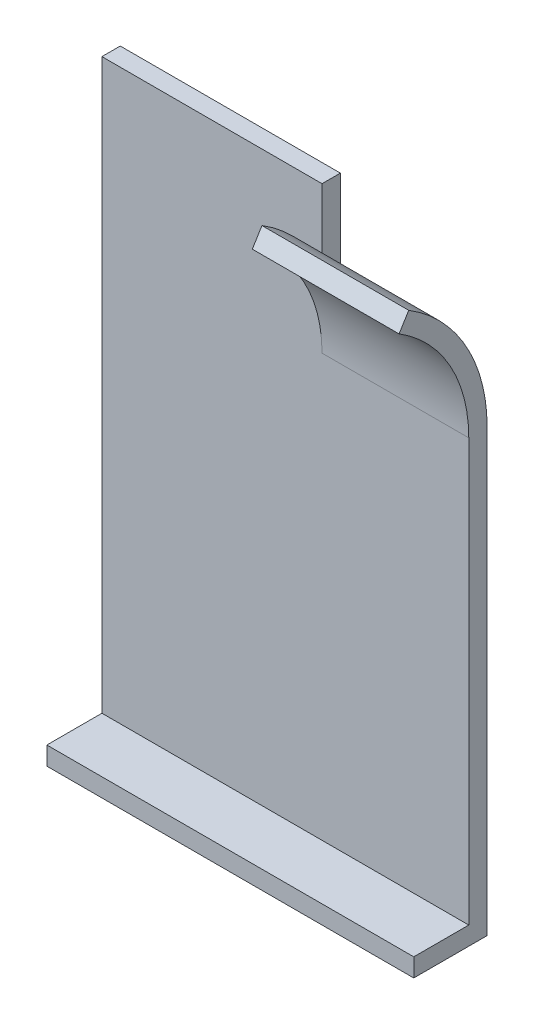
ISO-10303-21;
HEADER;
FILE_DESCRIPTION(('STEP AP214'),'2;1');
FILE_NAME('part.step','',(''),(''),'','','');
FILE_SCHEMA(('AUTOMOTIVE_DESIGN { 1 0 10303 214 1 1 1 1 }'));
ENDSEC;
DATA;
#1=APPLICATION_CONTEXT('core data for automotive mechanical design processes');
#2=APPLICATION_PROTOCOL_DEFINITION('international standard','automotive_design',2000,#1);
#3=PRODUCT_CONTEXT('',#1,'mechanical');
#4=PRODUCT('Part','Part','',(#3));
#5=PRODUCT_RELATED_PRODUCT_CATEGORY('part','',(#4));
#6=PRODUCT_DEFINITION_FORMATION('','',#4);
#7=PRODUCT_DEFINITION_CONTEXT('part definition',#1,'design');
#8=PRODUCT_DEFINITION('design','',#6,#7);
#9=PRODUCT_DEFINITION_SHAPE('','',#8);
#10=(LENGTH_UNIT() NAMED_UNIT(*) SI_UNIT(.MILLI.,.METRE.));
#11=(NAMED_UNIT(*) PLANE_ANGLE_UNIT() SI_UNIT($,.RADIAN.));
#12=(NAMED_UNIT(*) SI_UNIT($,.STERADIAN.) SOLID_ANGLE_UNIT());
#13=UNCERTAINTY_MEASURE_WITH_UNIT(LENGTH_MEASURE(1.E-05),#10,'distance_accuracy_value','');
#14=(GEOMETRIC_REPRESENTATION_CONTEXT(3) GLOBAL_UNCERTAINTY_ASSIGNED_CONTEXT((#13)) GLOBAL_UNIT_ASSIGNED_CONTEXT((#10,
#11,#12)) REPRESENTATION_CONTEXT('',''));
#15=CARTESIAN_POINT('',(0.,0.,0.));
#16=DIRECTION('',(0.,0.,1.));
#17=DIRECTION('',(1.,0.,0.));
#18=AXIS2_PLACEMENT_3D('',#15,#16,#17);
#19=CARTESIAN_POINT('',(38.1,101.6,3.175));
#20=DIRECTION('',(-1.,0.,0.));
#21=DIRECTION('',(0.,0.,1.));
#22=AXIS2_PLACEMENT_3D('',#19,#20,#21);
#23=PLANE('',#22);
#24=DIRECTION('',(0.,1.,0.));
#25=VECTOR('',#24,1.);
#26=CARTESIAN_POINT('',(38.1,101.6,3.175));
#27=LINE('',#26,#25);
#28=CARTESIAN_POINT('',(38.1,89.2908603613361,3.175));
#29=VERTEX_POINT('',#28);
#30=CARTESIAN_POINT('',(38.1,101.6,3.175));
#31=VERTEX_POINT('',#30);
#32=EDGE_CURVE('E166',#29,#31,#27,.T.);
#33=ORIENTED_EDGE('',*,*,#32,.F.);
#34=CARTESIAN_POINT('',(38.1,76.2,28.575));
#35=DIRECTION('',(-1.,0.,0.));
#36=DIRECTION('',(0.,0.,1.));
#37=AXIS2_PLACEMENT_3D('',#34,#35,#36);
#38=CIRCLE('',#37,28.575);
#39=CARTESIAN_POINT('',(38.1,76.2,0.));
#40=VERTEX_POINT('',#39);
#41=EDGE_CURVE('E157',#40,#29,#38,.F.);
#42=ORIENTED_EDGE('',*,*,#41,.F.);
#43=DIRECTION('',(0.,1.,0.));
#44=VECTOR('',#43,1.);
#45=CARTESIAN_POINT('',(38.1,101.6,0.));
#46=LINE('',#45,#44);
#47=CARTESIAN_POINT('',(38.1,101.6,0.));
#48=VERTEX_POINT('',#47);
#49=EDGE_CURVE('E181',#40,#48,#46,.T.);
#50=ORIENTED_EDGE('',*,*,#49,.T.);
#51=DIRECTION('',(0.,0.,-1.));
#52=VECTOR('',#51,1.);
#53=CARTESIAN_POINT('',(38.1,101.6,3.175));
#54=LINE('',#53,#52);
#55=EDGE_CURVE('E40',#31,#48,#54,.T.);
#56=ORIENTED_EDGE('',*,*,#55,.F.);
#57=EDGE_LOOP('',(#33,#42,#50,#56));
#58=FACE_BOUND('',#57,.T.);
#59=ADVANCED_FACE('F32',(#58),#23,.F.);
#60=CARTESIAN_POINT('',(63.5,0.,3.175));
#61=DIRECTION('',(0.,1.,0.));
#62=DIRECTION('',(0.,0.,1.));
#63=AXIS2_PLACEMENT_3D('',#60,#61,#62);
#64=PLANE('',#63);
#65=DIRECTION('',(1.,0.,0.));
#66=VECTOR('',#65,1.);
#67=CARTESIAN_POINT('',(63.5,0.,0.));
#68=LINE('',#67,#66);
#69=CARTESIAN_POINT('',(0.,0.,0.));
#70=VERTEX_POINT('',#69);
#71=CARTESIAN_POINT('',(63.5,0.,0.));
#72=VERTEX_POINT('',#71);
#73=EDGE_CURVE('E151',#70,#72,#68,.T.);
#74=ORIENTED_EDGE('',*,*,#73,.T.);
#75=DIRECTION('',(0.,0.,-1.));
#76=VECTOR('',#75,1.);
#77=CARTESIAN_POINT('',(63.5,0.,3.175));
#78=LINE('',#77,#76);
#79=CARTESIAN_POINT('',(63.5,0.,12.7));
#80=VERTEX_POINT('',#79);
#81=EDGE_CURVE('E11',#80,#72,#78,.T.);
#82=ORIENTED_EDGE('',*,*,#81,.F.);
#83=DIRECTION('',(1.,0.,0.));
#84=VECTOR('',#83,1.);
#85=CARTESIAN_POINT('',(-13.0908603613361,0.,12.7));
#86=LINE('',#85,#84);
#87=CARTESIAN_POINT('',(0.,0.,12.7));
#88=VERTEX_POINT('',#87);
#89=EDGE_CURVE('E127',#88,#80,#86,.T.);
#90=ORIENTED_EDGE('',*,*,#89,.F.);
#91=DIRECTION('',(0.,0.,-1.));
#92=VECTOR('',#91,1.);
#93=CARTESIAN_POINT('',(0.,0.,3.175));
#94=LINE('',#93,#92);
#95=EDGE_CURVE('E173',#88,#70,#94,.T.);
#96=ORIENTED_EDGE('',*,*,#95,.T.);
#97=EDGE_LOOP('',(#74,#82,#90,#96));
#98=FACE_BOUND('',#97,.T.);
#99=ADVANCED_FACE('F34',(#98),#64,.F.);
#100=CARTESIAN_POINT('',(63.5,76.2,3.175));
#101=DIRECTION('',(-1.,0.,0.));
#102=DIRECTION('',(0.,0.,1.));
#103=AXIS2_PLACEMENT_3D('',#100,#101,#102);
#104=PLANE('',#103);
#105=DIRECTION('',(0.,1.,0.));
#106=VECTOR('',#105,1.);
#107=CARTESIAN_POINT('',(63.5,76.2,3.175));
#108=LINE('',#107,#106);
#109=CARTESIAN_POINT('',(63.5,3.175,3.175));
#110=VERTEX_POINT('',#109);
#111=CARTESIAN_POINT('',(63.5,76.2,3.175));
#112=VERTEX_POINT('',#111);
#113=EDGE_CURVE('E116',#110,#112,#108,.T.);
#114=ORIENTED_EDGE('',*,*,#113,.F.);
#115=DIRECTION('',(0.,0.,1.));
#116=VECTOR('',#115,1.);
#117=CARTESIAN_POINT('',(63.5,3.175,12.7));
#118=LINE('',#117,#116);
#119=CARTESIAN_POINT('',(63.5,3.175,12.7));
#120=VERTEX_POINT('',#119);
#121=EDGE_CURVE('E110',#110,#120,#118,.T.);
#122=ORIENTED_EDGE('',*,*,#121,.T.);
#123=DIRECTION('',(0.,-1.,0.));
#124=VECTOR('',#123,1.);
#125=CARTESIAN_POINT('',(63.5,0.,12.7));
#126=LINE('',#125,#124);
#127=EDGE_CURVE('E114',#120,#80,#126,.T.);
#128=ORIENTED_EDGE('',*,*,#127,.T.);
#129=ORIENTED_EDGE('',*,*,#81,.T.);
#130=DIRECTION('',(0.,1.,0.));
#131=VECTOR('',#130,1.);
#132=CARTESIAN_POINT('',(63.5,76.2,0.));
#133=LINE('',#132,#131);
#134=CARTESIAN_POINT('',(63.5,76.2,0.));
#135=VERTEX_POINT('',#134);
#136=EDGE_CURVE('E176',#72,#135,#133,.T.);
#137=ORIENTED_EDGE('',*,*,#136,.T.);
#138=CARTESIAN_POINT('',(63.5,76.2,28.575));
#139=DIRECTION('',(1.,0.,0.));
#140=DIRECTION('',(0.,0.,-1.));
#141=AXIS2_PLACEMENT_3D('',#138,#139,#140);
#142=CIRCLE('',#141,28.575);
#143=CARTESIAN_POINT('',(63.5,100.520246123022,13.573125));
#144=VERTEX_POINT('',#143);
#145=EDGE_CURVE('E144',#135,#144,#142,.T.);
#146=ORIENTED_EDGE('',*,*,#145,.T.);
#147=DIRECTION('',(0.,-0.85110222652746,0.525));
#148=VECTOR('',#147,1.);
#149=CARTESIAN_POINT('',(63.5,97.8179965537975,15.24));
#150=LINE('',#149,#148);
#151=CARTESIAN_POINT('',(63.5,97.8179965537975,15.24));
#152=VERTEX_POINT('',#151);
#153=EDGE_CURVE('E140',#144,#152,#150,.T.);
#154=ORIENTED_EDGE('',*,*,#153,.T.);
#155=CARTESIAN_POINT('',(63.5,76.2,28.575));
#156=DIRECTION('',(-1.,0.,0.));
#157=DIRECTION('',(0.,0.,-1.));
#158=AXIS2_PLACEMENT_3D('',#155,#156,#157);
#159=CIRCLE('',#158,25.4);
#160=EDGE_CURVE('E139',#152,#112,#159,.T.);
#161=ORIENTED_EDGE('',*,*,#160,.T.);
#162=EDGE_LOOP('',(#114,#122,#128,#129,#137,#146,#154,#161));
#163=FACE_BOUND('',#162,.T.);
#164=ADVANCED_FACE('F112',(#163),#104,.F.);
#165=CARTESIAN_POINT('',(0.,101.6,3.175));
#166=DIRECTION('',(0.,-1.,0.));
#167=DIRECTION('',(0.,0.,-1.));
#168=AXIS2_PLACEMENT_3D('',#165,#166,#167);
#169=PLANE('',#168);
#170=DIRECTION('',(-1.,0.,0.));
#171=VECTOR('',#170,1.);
#172=CARTESIAN_POINT('',(0.,101.6,0.));
#173=LINE('',#172,#171);
#174=CARTESIAN_POINT('',(0.,101.6,0.));
#175=VERTEX_POINT('',#174);
#176=EDGE_CURVE('E183',#48,#175,#173,.T.);
#177=ORIENTED_EDGE('',*,*,#176,.T.);
#178=DIRECTION('',(0.,0.,-1.));
#179=VECTOR('',#178,1.);
#180=CARTESIAN_POINT('',(0.,101.6,3.175));
#181=LINE('',#180,#179);
#182=CARTESIAN_POINT('',(0.,101.6,3.175));
#183=VERTEX_POINT('',#182);
#184=EDGE_CURVE('E188',#183,#175,#181,.T.);
#185=ORIENTED_EDGE('',*,*,#184,.F.);
#186=DIRECTION('',(-1.,0.,0.));
#187=VECTOR('',#186,1.);
#188=CARTESIAN_POINT('',(0.,101.6,3.175));
#189=LINE('',#188,#187);
#190=EDGE_CURVE('E170',#31,#183,#189,.T.);
#191=ORIENTED_EDGE('',*,*,#190,.F.);
#192=ORIENTED_EDGE('',*,*,#55,.T.);
#193=EDGE_LOOP('',(#177,#185,#191,#192));
#194=FACE_BOUND('',#193,.T.);
#195=ADVANCED_FACE('F195',(#194),#169,.F.);
#196=CARTESIAN_POINT('',(0.,0.,3.175));
#197=DIRECTION('',(1.,0.,0.));
#198=DIRECTION('',(0.,0.,-1.));
#199=AXIS2_PLACEMENT_3D('',#196,#197,#198);
#200=PLANE('',#199);
#201=DIRECTION('',(0.,-1.,0.));
#202=VECTOR('',#201,1.);
#203=CARTESIAN_POINT('',(0.,0.,0.));
#204=LINE('',#203,#202);
#205=EDGE_CURVE('E164',#175,#70,#204,.T.);
#206=ORIENTED_EDGE('',*,*,#205,.T.);
#207=ORIENTED_EDGE('',*,*,#95,.F.);
#208=DIRECTION('',(0.,1.,0.));
#209=VECTOR('',#208,1.);
#210=CARTESIAN_POINT('',(0.,0.,12.7));
#211=LINE('',#210,#209);
#212=CARTESIAN_POINT('',(0.,3.175,12.7));
#213=VERTEX_POINT('',#212);
#214=EDGE_CURVE('E135',#88,#213,#211,.T.);
#215=ORIENTED_EDGE('',*,*,#214,.T.);
#216=DIRECTION('',(0.,0.,-1.));
#217=VECTOR('',#216,1.);
#218=CARTESIAN_POINT('',(0.,3.175,12.7));
#219=LINE('',#218,#217);
#220=CARTESIAN_POINT('',(0.,3.175,3.175));
#221=VERTEX_POINT('',#220);
#222=EDGE_CURVE('E124',#213,#221,#219,.T.);
#223=ORIENTED_EDGE('',*,*,#222,.T.);
#224=DIRECTION('',(0.,-1.,0.));
#225=VECTOR('',#224,1.);
#226=CARTESIAN_POINT('',(0.,0.,3.175));
#227=LINE('',#226,#225);
#228=EDGE_CURVE('E47',#183,#221,#227,.T.);
#229=ORIENTED_EDGE('',*,*,#228,.F.);
#230=ORIENTED_EDGE('',*,*,#184,.T.);
#231=EDGE_LOOP('',(#206,#207,#215,#223,#229,#230));
#232=FACE_BOUND('',#231,.T.);
#233=ADVANCED_FACE('F205',(#232),#200,.F.);
#234=CARTESIAN_POINT('',(0.,0.,3.175));
#235=DIRECTION('',(0.,0.,-1.));
#236=DIRECTION('',(-1.,0.,0.));
#237=AXIS2_PLACEMENT_3D('',#234,#235,#236);
#238=PLANE('',#237);
#239=ORIENTED_EDGE('',*,*,#228,.T.);
#240=DIRECTION('',(1.,0.,0.));
#241=VECTOR('',#240,1.);
#242=CARTESIAN_POINT('',(0.,3.175,3.175));
#243=LINE('',#242,#241);
#244=EDGE_CURVE('E51',#221,#110,#243,.T.);
#245=ORIENTED_EDGE('',*,*,#244,.T.);
#246=ORIENTED_EDGE('',*,*,#113,.T.);
#247=DIRECTION('',(-1.,0.,0.));
#248=VECTOR('',#247,1.);
#249=CARTESIAN_POINT('',(38.1,76.2,3.175));
#250=LINE('',#249,#248);
#251=CARTESIAN_POINT('',(38.1,76.2,3.175));
#252=VERTEX_POINT('',#251);
#253=EDGE_CURVE('E163',#112,#252,#250,.T.);
#254=ORIENTED_EDGE('',*,*,#253,.T.);
#255=EDGE_CURVE('E167',#252,#29,#27,.T.);
#256=ORIENTED_EDGE('',*,*,#255,.T.);
#257=ORIENTED_EDGE('',*,*,#32,.T.);
#258=ORIENTED_EDGE('',*,*,#190,.T.);
#259=EDGE_LOOP('',(#239,#245,#246,#254,#256,#257,#258));
#260=FACE_BOUND('',#259,.T.);
#261=ADVANCED_FACE('F222',(#260),#238,.F.);
#262=CARTESIAN_POINT('',(0.,0.,0.));
#263=DIRECTION('',(0.,0.,-1.));
#264=DIRECTION('',(-1.,0.,0.));
#265=AXIS2_PLACEMENT_3D('',#262,#263,#264);
#266=PLANE('',#265);
#267=DIRECTION('',(-1.,0.,0.));
#268=VECTOR('',#267,1.);
#269=CARTESIAN_POINT('',(38.1,76.2,0.));
#270=LINE('',#269,#268);
#271=EDGE_CURVE('E178',#135,#40,#270,.T.);
#272=ORIENTED_EDGE('',*,*,#271,.F.);
#273=ORIENTED_EDGE('',*,*,#136,.F.);
#274=ORIENTED_EDGE('',*,*,#73,.F.);
#275=ORIENTED_EDGE('',*,*,#205,.F.);
#276=ORIENTED_EDGE('',*,*,#176,.F.);
#277=ORIENTED_EDGE('',*,*,#49,.F.);
#278=EDGE_LOOP('',(#272,#273,#274,#275,#276,#277));
#279=FACE_BOUND('',#278,.T.);
#280=ADVANCED_FACE('F201',(#279),#266,.T.);
#281=CARTESIAN_POINT('',(38.1,101.6,3.175));
#282=DIRECTION('',(-1.,0.,0.));
#283=DIRECTION('',(0.,0.,1.));
#284=AXIS2_PLACEMENT_3D('',#281,#282,#283);
#285=PLANE('',#284);
#286=ORIENTED_EDGE('',*,*,#255,.F.);
#287=CARTESIAN_POINT('',(38.1,76.2,28.575));
#288=DIRECTION('',(-1.,0.,0.));
#289=DIRECTION('',(0.,0.,1.));
#290=AXIS2_PLACEMENT_3D('',#287,#288,#289);
#291=CIRCLE('',#290,25.4);
#292=CARTESIAN_POINT('',(38.1,97.8179965537975,15.24));
#293=VERTEX_POINT('',#292);
#294=EDGE_CURVE('E148',#293,#252,#291,.T.);
#295=ORIENTED_EDGE('',*,*,#294,.F.);
#296=DIRECTION('',(0.,-0.85110222652746,0.525));
#297=VECTOR('',#296,1.);
#298=CARTESIAN_POINT('',(38.1,97.8179965537975,15.24));
#299=LINE('',#298,#297);
#300=CARTESIAN_POINT('',(38.1,100.520246123022,13.573125));
#301=VERTEX_POINT('',#300);
#302=EDGE_CURVE('E153',#301,#293,#299,.T.);
#303=ORIENTED_EDGE('',*,*,#302,.F.);
#304=EDGE_CURVE('E143',#29,#301,#38,.F.);
#305=ORIENTED_EDGE('',*,*,#304,.F.);
#306=EDGE_LOOP('',(#286,#295,#303,#305));
#307=FACE_BOUND('',#306,.T.);
#308=ADVANCED_FACE('F224',(#307),#285,.T.);
#309=CARTESIAN_POINT('',(9.39926879878538,76.2,28.575));
#310=DIRECTION('',(1.,0.,0.));
#311=DIRECTION('',(0.,0.,-1.));
#312=AXIS2_PLACEMENT_3D('',#309,#310,#311);
#313=CYLINDRICAL_SURFACE('',#312,28.575);
#314=ORIENTED_EDGE('',*,*,#271,.T.);
#315=ORIENTED_EDGE('',*,*,#41,.T.);
#316=ORIENTED_EDGE('',*,*,#304,.T.);
#317=DIRECTION('',(1.,0.,0.));
#318=VECTOR('',#317,1.);
#319=CARTESIAN_POINT('',(9.39926879878538,100.520246123022,13.573125));
#320=LINE('',#319,#318);
#321=EDGE_CURVE('E156',#301,#144,#320,.T.);
#322=ORIENTED_EDGE('',*,*,#321,.T.);
#323=ORIENTED_EDGE('',*,*,#145,.F.);
#324=EDGE_LOOP('',(#314,#315,#316,#322,#323));
#325=FACE_BOUND('',#324,.T.);
#326=ADVANCED_FACE('F210',(#325),#313,.T.);
#327=CARTESIAN_POINT('',(9.39926879878538,97.8179965537975,15.24));
#328=DIRECTION('',(0.,0.525,0.85110222652746));
#329=DIRECTION('',(0.,-0.85110222652746,0.525));
#330=AXIS2_PLACEMENT_3D('',#327,#328,#329);
#331=PLANE('',#330);
#332=ORIENTED_EDGE('',*,*,#321,.F.);
#333=ORIENTED_EDGE('',*,*,#302,.T.);
#334=DIRECTION('',(1.,0.,0.));
#335=VECTOR('',#334,1.);
#336=CARTESIAN_POINT('',(9.39926879878538,97.8179965537975,15.24));
#337=LINE('',#336,#335);
#338=EDGE_CURVE('E152',#293,#152,#337,.T.);
#339=ORIENTED_EDGE('',*,*,#338,.T.);
#340=ORIENTED_EDGE('',*,*,#153,.F.);
#341=EDGE_LOOP('',(#332,#333,#339,#340));
#342=FACE_BOUND('',#341,.T.);
#343=ADVANCED_FACE('F215',(#342),#331,.T.);
#344=CARTESIAN_POINT('',(9.39926879878538,76.2,28.575));
#345=DIRECTION('',(1.,0.,0.));
#346=DIRECTION('',(0.,0.,-1.));
#347=AXIS2_PLACEMENT_3D('',#344,#345,#346);
#348=CYLINDRICAL_SURFACE('',#347,25.4);
#349=ORIENTED_EDGE('',*,*,#338,.F.);
#350=ORIENTED_EDGE('',*,*,#294,.T.);
#351=ORIENTED_EDGE('',*,*,#253,.F.);
#352=ORIENTED_EDGE('',*,*,#160,.F.);
#353=EDGE_LOOP('',(#349,#350,#351,#352));
#354=FACE_BOUND('',#353,.T.);
#355=ADVANCED_FACE('F220',(#354),#348,.F.);
#356=CARTESIAN_POINT('',(-13.0908603613361,3.175,12.7));
#357=DIRECTION('',(0.,1.,0.));
#358=DIRECTION('',(0.,0.,1.));
#359=AXIS2_PLACEMENT_3D('',#356,#357,#358);
#360=PLANE('',#359);
#361=ORIENTED_EDGE('',*,*,#244,.F.);
#362=ORIENTED_EDGE('',*,*,#222,.F.);
#363=DIRECTION('',(1.,0.,0.));
#364=VECTOR('',#363,1.);
#365=CARTESIAN_POINT('',(-13.0908603613361,3.175,12.7));
#366=LINE('',#365,#364);
#367=EDGE_CURVE('E121',#213,#120,#366,.T.);
#368=ORIENTED_EDGE('',*,*,#367,.T.);
#369=ORIENTED_EDGE('',*,*,#121,.F.);
#370=EDGE_LOOP('',(#361,#362,#368,#369));
#371=FACE_BOUND('',#370,.T.);
#372=ADVANCED_FACE('F122',(#371),#360,.T.);
#373=CARTESIAN_POINT('',(-13.0908603613361,0.,12.7));
#374=DIRECTION('',(0.,0.,1.));
#375=DIRECTION('',(1.,0.,0.));
#376=AXIS2_PLACEMENT_3D('',#373,#374,#375);
#377=PLANE('',#376);
#378=ORIENTED_EDGE('',*,*,#214,.F.);
#379=ORIENTED_EDGE('',*,*,#89,.T.);
#380=ORIENTED_EDGE('',*,*,#127,.F.);
#381=ORIENTED_EDGE('',*,*,#367,.F.);
#382=EDGE_LOOP('',(#378,#379,#380,#381));
#383=FACE_BOUND('',#382,.T.);
#384=ADVANCED_FACE('F130',(#383),#377,.T.);
#385=CLOSED_SHELL('',(#59,#99,#164,#195,#233,#261,#280,#308,#326,#343,#355,#372,#384));
#386=MANIFOLD_SOLID_BREP('B2',#385);
#387=ADVANCED_BREP_SHAPE_REPRESENTATION('',(#18,#386),#14);
#388=SHAPE_DEFINITION_REPRESENTATION(#9,#387);
ENDSEC;
END-ISO-10303-21;
